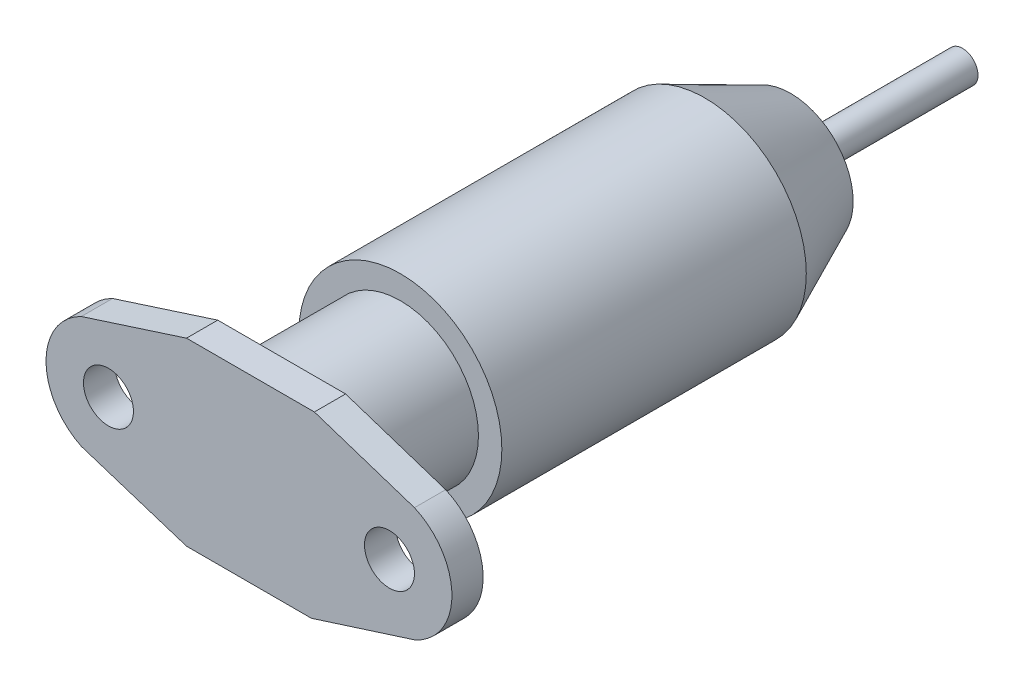
ISO-10303-21;
HEADER;
FILE_DESCRIPTION(('STEP AP214'),'2;1');
FILE_NAME('part.step','',(''),(''),'','','');
FILE_SCHEMA(('AUTOMOTIVE_DESIGN { 1 0 10303 214 1 1 1 1 }'));
ENDSEC;
DATA;
#1=APPLICATION_CONTEXT('core data for automotive mechanical design processes');
#2=APPLICATION_PROTOCOL_DEFINITION('international standard','automotive_design',2000,#1);
#3=PRODUCT_CONTEXT('',#1,'mechanical');
#4=PRODUCT('Part','Part','',(#3));
#5=PRODUCT_RELATED_PRODUCT_CATEGORY('part','',(#4));
#6=PRODUCT_DEFINITION_FORMATION('','',#4);
#7=PRODUCT_DEFINITION_CONTEXT('part definition',#1,'design');
#8=PRODUCT_DEFINITION('design','',#6,#7);
#9=PRODUCT_DEFINITION_SHAPE('','',#8);
#10=(LENGTH_UNIT() NAMED_UNIT(*) SI_UNIT(.MILLI.,.METRE.));
#11=(NAMED_UNIT(*) PLANE_ANGLE_UNIT() SI_UNIT($,.RADIAN.));
#12=(NAMED_UNIT(*) SI_UNIT($,.STERADIAN.) SOLID_ANGLE_UNIT());
#13=UNCERTAINTY_MEASURE_WITH_UNIT(LENGTH_MEASURE(1.E-05),#10,'distance_accuracy_value','');
#14=(GEOMETRIC_REPRESENTATION_CONTEXT(3) GLOBAL_UNCERTAINTY_ASSIGNED_CONTEXT((#13)) GLOBAL_UNIT_ASSIGNED_CONTEXT((#10,
#11,#12)) REPRESENTATION_CONTEXT('',''));
#15=CARTESIAN_POINT('',(0.,0.,0.));
#16=DIRECTION('',(0.,0.,1.));
#17=DIRECTION('',(1.,0.,0.));
#18=AXIS2_PLACEMENT_3D('',#15,#16,#17);
#19=CARTESIAN_POINT('',(-2.22651893290281,6.92250518995969,2.));
#20=DIRECTION('',(0.306187159635364,-0.95197133532183,0.));
#21=DIRECTION('',(0.95197133532183,0.306187159635364,0.));
#22=AXIS2_PLACEMENT_3D('',#19,#20,#21);
#23=PLANE('',#22);
#24=DIRECTION('',(-0.95197133532183,-0.306187159635364,0.));
#25=VECTOR('',#24,1.);
#26=CARTESIAN_POINT('',(-2.22651893290281,6.92250518995969,0.));
#27=LINE('',#26,#25);
#28=CARTESIAN_POINT('',(-7.25688073394496,5.3045655160948,0.));
#29=VERTEX_POINT('',#28);
#30=CARTESIAN_POINT('',(-13.9940276529524,3.13766426325439,0.));
#31=VERTEX_POINT('',#30);
#32=EDGE_CURVE('E157',#29,#31,#27,.T.);
#33=ORIENTED_EDGE('',*,*,#32,.T.);
#34=DIRECTION('',(0.,0.,-1.));
#35=VECTOR('',#34,1.);
#36=CARTESIAN_POINT('',(-13.9940276529524,3.13766426325439,2.));
#37=LINE('',#36,#35);
#38=CARTESIAN_POINT('',(-13.9940276529524,3.13766426325439,2.));
#39=VERTEX_POINT('',#38);
#40=EDGE_CURVE('E201',#39,#31,#37,.T.);
#41=ORIENTED_EDGE('',*,*,#40,.F.);
#42=DIRECTION('',(-0.95197133532183,-0.306187159635364,0.));
#43=VECTOR('',#42,1.);
#44=CARTESIAN_POINT('',(-2.22651893290281,6.92250518995969,2.));
#45=LINE('',#44,#43);
#46=CARTESIAN_POINT('',(-7.25688073394496,5.3045655160948,2.));
#47=VERTEX_POINT('',#46);
#48=EDGE_CURVE('E235',#47,#39,#45,.T.);
#49=ORIENTED_EDGE('',*,*,#48,.F.);
#50=DIRECTION('',(0.,0.,-1.));
#51=VECTOR('',#50,1.);
#52=CARTESIAN_POINT('',(-7.25688073394496,5.3045655160948,2.));
#53=LINE('',#52,#51);
#54=EDGE_CURVE('E63',#47,#29,#53,.T.);
#55=ORIENTED_EDGE('',*,*,#54,.T.);
#56=EDGE_LOOP('',(#33,#41,#49,#55));
#57=FACE_BOUND('',#56,.T.);
#58=ADVANCED_FACE('F43',(#57),#23,.F.);
#59=CARTESIAN_POINT('',(-12.256880733945,-0.465434483905203,2.));
#60=DIRECTION('',(0.,0.,-1.));
#61=DIRECTION('',(-1.,0.,0.));
#62=AXIS2_PLACEMENT_3D('',#59,#60,#61);
#63=CYLINDRICAL_SURFACE('',#62,4.);
#64=CARTESIAN_POINT('',(-12.256880733945,-0.465434483905203,0.));
#65=DIRECTION('',(0.,0.,1.));
#66=DIRECTION('',(1.,0.,0.));
#67=AXIS2_PLACEMENT_3D('',#64,#65,#66);
#68=CIRCLE('',#67,4.);
#69=CARTESIAN_POINT('',(-13.9940276529524,-4.06853323106481,0.));
#70=VERTEX_POINT('',#69);
#71=EDGE_CURVE('E160',#31,#70,#68,.T.);
#72=ORIENTED_EDGE('',*,*,#71,.T.);
#73=DIRECTION('',(0.,0.,-1.));
#74=VECTOR('',#73,1.);
#75=CARTESIAN_POINT('',(-13.9940276529524,-4.06853323106481,2.));
#76=LINE('',#75,#74);
#77=CARTESIAN_POINT('',(-13.9940276529524,-4.06853323106481,2.));
#78=VERTEX_POINT('',#77);
#79=EDGE_CURVE('E198',#78,#70,#76,.T.);
#80=ORIENTED_EDGE('',*,*,#79,.F.);
#81=CARTESIAN_POINT('',(-12.256880733945,-0.465434483905203,2.));
#82=DIRECTION('',(0.,0.,1.));
#83=DIRECTION('',(1.,0.,0.));
#84=AXIS2_PLACEMENT_3D('',#81,#82,#83);
#85=CIRCLE('',#84,4.);
#86=EDGE_CURVE('E102',#39,#78,#85,.T.);
#87=ORIENTED_EDGE('',*,*,#86,.F.);
#88=ORIENTED_EDGE('',*,*,#40,.T.);
#89=EDGE_LOOP('',(#72,#80,#87,#88));
#90=FACE_BOUND('',#89,.T.);
#91=ADVANCED_FACE('F272',(#90),#63,.T.);
#92=CARTESIAN_POINT('',(-2.49784992212738,-7.76610465518193,2.));
#93=DIRECTION('',(-0.306187159635364,-0.95197133532183,0.));
#94=DIRECTION('',(0.95197133532183,-0.306187159635364,0.));
#95=AXIS2_PLACEMENT_3D('',#92,#93,#94);
#96=PLANE('',#95);
#97=DIRECTION('',(-0.95197133532183,0.306187159635364,0.));
#98=VECTOR('',#97,1.);
#99=CARTESIAN_POINT('',(-2.49784992212738,-7.76610465518193,0.));
#100=LINE('',#99,#98);
#101=CARTESIAN_POINT('',(-7.25688073394496,-6.2354344839052,0.));
#102=VERTEX_POINT('',#101);
#103=EDGE_CURVE('E164',#102,#70,#100,.T.);
#104=ORIENTED_EDGE('',*,*,#103,.F.);
#105=DIRECTION('',(0.,0.,-1.));
#106=VECTOR('',#105,1.);
#107=CARTESIAN_POINT('',(-7.25688073394496,-6.2354344839052,2.));
#108=LINE('',#107,#106);
#109=CARTESIAN_POINT('',(-7.25688073394496,-6.2354344839052,2.));
#110=VERTEX_POINT('',#109);
#111=EDGE_CURVE('E195',#110,#102,#108,.T.);
#112=ORIENTED_EDGE('',*,*,#111,.F.);
#113=DIRECTION('',(-0.95197133532183,0.306187159635364,0.));
#114=VECTOR('',#113,1.);
#115=CARTESIAN_POINT('',(-2.49784992212738,-7.76610465518193,2.));
#116=LINE('',#115,#114);
#117=EDGE_CURVE('E240',#110,#78,#116,.T.);
#118=ORIENTED_EDGE('',*,*,#117,.T.);
#119=ORIENTED_EDGE('',*,*,#79,.T.);
#120=EDGE_LOOP('',(#104,#112,#118,#119));
#121=FACE_BOUND('',#120,.T.);
#122=ADVANCED_FACE('F277',(#121),#96,.T.);
#123=CARTESIAN_POINT('',(0.,-6.2354344839052,2.));
#124=DIRECTION('',(0.,1.,0.));
#125=DIRECTION('',(0.,0.,1.));
#126=AXIS2_PLACEMENT_3D('',#123,#124,#125);
#127=PLANE('',#126);
#128=DIRECTION('',(1.,0.,0.));
#129=VECTOR('',#128,1.);
#130=CARTESIAN_POINT('',(0.,-6.2354344839052,0.));
#131=LINE('',#130,#129);
#132=CARTESIAN_POINT('',(0.743119266055036,-6.2354344839052,0.));
#133=VERTEX_POINT('',#132);
#134=EDGE_CURVE('E168',#102,#133,#131,.T.);
#135=ORIENTED_EDGE('',*,*,#134,.T.);
#136=DIRECTION('',(0.,0.,-1.));
#137=VECTOR('',#136,1.);
#138=CARTESIAN_POINT('',(0.743119266055036,-6.2354344839052,2.));
#139=LINE('',#138,#137);
#140=CARTESIAN_POINT('',(0.743119266055036,-6.2354344839052,2.));
#141=VERTEX_POINT('',#140);
#142=EDGE_CURVE('E191',#141,#133,#139,.T.);
#143=ORIENTED_EDGE('',*,*,#142,.F.);
#144=DIRECTION('',(1.,0.,0.));
#145=VECTOR('',#144,1.);
#146=CARTESIAN_POINT('',(0.,-6.2354344839052,2.));
#147=LINE('',#146,#145);
#148=EDGE_CURVE('E244',#110,#141,#147,.T.);
#149=ORIENTED_EDGE('',*,*,#148,.F.);
#150=ORIENTED_EDGE('',*,*,#111,.T.);
#151=EDGE_LOOP('',(#135,#143,#149,#150));
#152=FACE_BOUND('',#151,.T.);
#153=ADVANCED_FACE('F251',(#152),#127,.F.);
#154=CARTESIAN_POINT('',(1.87302770760542,-5.87521810010068,2.));
#155=DIRECTION('',(-0.303739643333645,0.952755072968678,0.));
#156=DIRECTION('',(-0.952755072968678,-0.303739643333645,0.));
#157=AXIS2_PLACEMENT_3D('',#154,#155,#156);
#158=PLANE('',#157);
#159=DIRECTION('',(0.952755072968678,0.303739643333645,0.));
#160=VECTOR('',#159,1.);
#161=CARTESIAN_POINT('',(1.87302770760542,-5.87521810010068,0.));
#162=LINE('',#161,#160);
#163=CARTESIAN_POINT('',(7.34438998135382,-4.13094019203424,0.));
#164=VERTEX_POINT('',#163);
#165=EDGE_CURVE('E171',#133,#164,#162,.T.);
#166=ORIENTED_EDGE('',*,*,#165,.T.);
#167=DIRECTION('',(0.,0.,-1.));
#168=VECTOR('',#167,1.);
#169=CARTESIAN_POINT('',(7.34438998135382,-4.13094019203424,2.));
#170=LINE('',#169,#168);
#171=CARTESIAN_POINT('',(7.34438998135382,-4.13094019203424,2.));
#172=VERTEX_POINT('',#171);
#173=EDGE_CURVE('E128',#172,#164,#170,.T.);
#174=ORIENTED_EDGE('',*,*,#173,.F.);
#175=DIRECTION('',(0.952755072968678,0.303739643333645,0.));
#176=VECTOR('',#175,1.);
#177=CARTESIAN_POINT('',(1.87302770760542,-5.87521810010068,2.));
#178=LINE('',#177,#176);
#179=EDGE_CURVE('E136',#141,#172,#178,.T.);
#180=ORIENTED_EDGE('',*,*,#179,.F.);
#181=ORIENTED_EDGE('',*,*,#142,.T.);
#182=EDGE_LOOP('',(#166,#174,#180,#181));
#183=FACE_BOUND('',#182,.T.);
#184=ADVANCED_FACE('F255',(#183),#158,.F.);
#185=CARTESIAN_POINT('',(5.74311926605504,-0.465434483905203,2.));
#186=DIRECTION('',(0.,0.,-1.));
#187=DIRECTION('',(-1.,0.,0.));
#188=AXIS2_PLACEMENT_3D('',#185,#186,#187);
#189=CYLINDRICAL_SURFACE('',#188,4.);
#190=CARTESIAN_POINT('',(5.74311926605504,-0.465434483905203,0.));
#191=DIRECTION('',(0.,0.,1.));
#192=DIRECTION('',(1.,0.,0.));
#193=AXIS2_PLACEMENT_3D('',#190,#191,#192);
#194=CIRCLE('',#193,4.);
#195=CARTESIAN_POINT('',(7.34438998135382,3.20007122422383,0.));
#196=VERTEX_POINT('',#195);
#197=EDGE_CURVE('E123',#196,#164,#194,.F.);
#198=ORIENTED_EDGE('',*,*,#197,.F.);
#199=DIRECTION('',(0.,0.,-1.));
#200=VECTOR('',#199,1.);
#201=CARTESIAN_POINT('',(7.34438998135382,3.20007122422383,2.));
#202=LINE('',#201,#200);
#203=CARTESIAN_POINT('',(7.34438998135382,3.20007122422383,2.));
#204=VERTEX_POINT('',#203);
#205=EDGE_CURVE('E118',#204,#196,#202,.T.);
#206=ORIENTED_EDGE('',*,*,#205,.F.);
#207=CARTESIAN_POINT('',(5.74311926605504,-0.465434483905203,2.));
#208=DIRECTION('',(0.,0.,1.));
#209=DIRECTION('',(1.,0.,0.));
#210=AXIS2_PLACEMENT_3D('',#207,#208,#209);
#211=CIRCLE('',#210,4.);
#212=EDGE_CURVE('E121',#204,#172,#211,.F.);
#213=ORIENTED_EDGE('',*,*,#212,.T.);
#214=ORIENTED_EDGE('',*,*,#173,.T.);
#215=EDGE_LOOP('',(#198,#206,#213,#214));
#216=FACE_BOUND('',#215,.T.);
#217=ADVANCED_FACE('F120',(#216),#189,.T.);
#218=CARTESIAN_POINT('',(1.66265514148175,5.06513007028699,2.));
#219=DIRECTION('',(0.311882073003011,0.95012081996941,0.));
#220=DIRECTION('',(-0.95012081996941,0.311882073003011,0.));
#221=AXIS2_PLACEMENT_3D('',#218,#219,#220);
#222=PLANE('',#221);
#223=DIRECTION('',(0.95012081996941,-0.311882073003011,0.));
#224=VECTOR('',#223,1.);
#225=CARTESIAN_POINT('',(1.66265514148175,5.06513007028699,0.));
#226=LINE('',#225,#224);
#227=CARTESIAN_POINT('',(0.933236486827441,5.3045655160948,0.));
#228=VERTEX_POINT('',#227);
#229=EDGE_CURVE('E177',#228,#196,#226,.T.);
#230=ORIENTED_EDGE('',*,*,#229,.F.);
#231=DIRECTION('',(0.,0.,-1.));
#232=VECTOR('',#231,1.);
#233=CARTESIAN_POINT('',(0.933236486827441,5.3045655160948,2.));
#234=LINE('',#233,#232);
#235=CARTESIAN_POINT('',(0.933236486827441,5.3045655160948,2.));
#236=VERTEX_POINT('',#235);
#237=EDGE_CURVE('E89',#236,#228,#234,.T.);
#238=ORIENTED_EDGE('',*,*,#237,.F.);
#239=DIRECTION('',(0.95012081996941,-0.311882073003011,0.));
#240=VECTOR('',#239,1.);
#241=CARTESIAN_POINT('',(1.66265514148175,5.06513007028699,2.));
#242=LINE('',#241,#240);
#243=EDGE_CURVE('E134',#236,#204,#242,.T.);
#244=ORIENTED_EDGE('',*,*,#243,.T.);
#245=ORIENTED_EDGE('',*,*,#205,.T.);
#246=EDGE_LOOP('',(#230,#238,#244,#245));
#247=FACE_BOUND('',#246,.T.);
#248=ADVANCED_FACE('F140',(#247),#222,.T.);
#249=CARTESIAN_POINT('',(5.74311926605504,-0.465434483905203,2.));
#250=DIRECTION('',(0.,0.,-1.));
#251=DIRECTION('',(-1.,0.,0.));
#252=AXIS2_PLACEMENT_3D('',#249,#250,#251);
#253=CYLINDRICAL_SURFACE('',#252,1.6);
#254=CARTESIAN_POINT('',(5.74311926605504,-0.465434483905203,2.));
#255=DIRECTION('',(0.,0.,1.));
#256=DIRECTION('',(1.,0.,0.));
#257=AXIS2_PLACEMENT_3D('',#254,#255,#256);
#258=CIRCLE('',#257,1.6);
#259=CARTESIAN_POINT('',(7.34311926605504,-0.465434483905203,2.));
#260=VERTEX_POINT('',#259);
#261=EDGE_CURVE('E231',#260,#260,#258,.T.);
#262=ORIENTED_EDGE('',*,*,#261,.T.);
#263=EDGE_LOOP('',(#262));
#264=FACE_BOUND('',#263,.T.);
#265=CARTESIAN_POINT('',(5.74311926605504,-0.465434483905203,0.));
#266=DIRECTION('',(0.,0.,1.));
#267=DIRECTION('',(1.,0.,0.));
#268=AXIS2_PLACEMENT_3D('',#265,#266,#267);
#269=CIRCLE('',#268,1.6);
#270=CARTESIAN_POINT('',(7.34311926605504,-0.465434483905203,0.));
#271=VERTEX_POINT('',#270);
#272=EDGE_CURVE('E152',#271,#271,#269,.T.);
#273=ORIENTED_EDGE('',*,*,#272,.F.);
#274=EDGE_LOOP('',(#273));
#275=FACE_BOUND('',#274,.T.);
#276=ADVANCED_FACE('F267',(#264,#275),#253,.F.);
#277=CARTESIAN_POINT('',(-12.256880733945,-0.465434483905203,2.));
#278=DIRECTION('',(0.,0.,-1.));
#279=DIRECTION('',(-1.,0.,0.));
#280=AXIS2_PLACEMENT_3D('',#277,#278,#279);
#281=CYLINDRICAL_SURFACE('',#280,1.6);
#282=CARTESIAN_POINT('',(-12.256880733945,-0.465434483905203,2.));
#283=DIRECTION('',(0.,0.,1.));
#284=DIRECTION('',(1.,0.,0.));
#285=AXIS2_PLACEMENT_3D('',#282,#283,#284);
#286=CIRCLE('',#285,1.6);
#287=CARTESIAN_POINT('',(-10.656880733945,-0.465434483905203,2.));
#288=VERTEX_POINT('',#287);
#289=EDGE_CURVE('E184',#288,#288,#286,.T.);
#290=ORIENTED_EDGE('',*,*,#289,.T.);
#291=EDGE_LOOP('',(#290));
#292=FACE_BOUND('',#291,.T.);
#293=CARTESIAN_POINT('',(-12.256880733945,-0.465434483905203,0.));
#294=DIRECTION('',(0.,0.,1.));
#295=DIRECTION('',(1.,0.,0.));
#296=AXIS2_PLACEMENT_3D('',#293,#294,#295);
#297=CIRCLE('',#296,1.6);
#298=CARTESIAN_POINT('',(-10.656880733945,-0.465434483905203,0.));
#299=VERTEX_POINT('',#298);
#300=EDGE_CURVE('E148',#299,#299,#297,.T.);
#301=ORIENTED_EDGE('',*,*,#300,.F.);
#302=EDGE_LOOP('',(#301));
#303=FACE_BOUND('',#302,.T.);
#304=ADVANCED_FACE('F45',(#292,#303),#281,.F.);
#305=CARTESIAN_POINT('',(0.,5.3045655160948,2.));
#306=DIRECTION('',(0.,1.,0.));
#307=DIRECTION('',(0.,0.,1.));
#308=AXIS2_PLACEMENT_3D('',#305,#306,#307);
#309=PLANE('',#308);
#310=DIRECTION('',(1.,0.,0.));
#311=VECTOR('',#310,1.);
#312=CARTESIAN_POINT('',(0.,5.3045655160948,0.));
#313=LINE('',#312,#311);
#314=EDGE_CURVE('E180',#29,#228,#313,.T.);
#315=ORIENTED_EDGE('',*,*,#314,.F.);
#316=ORIENTED_EDGE('',*,*,#54,.F.);
#317=DIRECTION('',(1.,0.,0.));
#318=VECTOR('',#317,1.);
#319=CARTESIAN_POINT('',(0.,5.3045655160948,2.));
#320=LINE('',#319,#318);
#321=EDGE_CURVE('E142',#47,#236,#320,.T.);
#322=ORIENTED_EDGE('',*,*,#321,.T.);
#323=ORIENTED_EDGE('',*,*,#237,.T.);
#324=EDGE_LOOP('',(#315,#316,#322,#323));
#325=FACE_BOUND('',#324,.T.);
#326=ADVANCED_FACE('F258',(#325),#309,.T.);
#327=CARTESIAN_POINT('',(0.,0.,2.));
#328=DIRECTION('',(0.,0.,1.));
#329=DIRECTION('',(1.,0.,0.));
#330=AXIS2_PLACEMENT_3D('',#327,#328,#329);
#331=PLANE('',#330);
#332=ORIENTED_EDGE('',*,*,#289,.F.);
#333=EDGE_LOOP('',(#332));
#334=FACE_BOUND('',#333,.T.);
#335=ORIENTED_EDGE('',*,*,#261,.F.);
#336=EDGE_LOOP('',(#335));
#337=FACE_BOUND('',#336,.T.);
#338=ORIENTED_EDGE('',*,*,#48,.T.);
#339=ORIENTED_EDGE('',*,*,#86,.T.);
#340=ORIENTED_EDGE('',*,*,#117,.F.);
#341=ORIENTED_EDGE('',*,*,#148,.T.);
#342=ORIENTED_EDGE('',*,*,#179,.T.);
#343=ORIENTED_EDGE('',*,*,#212,.F.);
#344=ORIENTED_EDGE('',*,*,#243,.F.);
#345=ORIENTED_EDGE('',*,*,#321,.F.);
#346=EDGE_LOOP('',(#338,#339,#340,#341,#342,#343,#344,#345));
#347=FACE_BOUND('',#346,.T.);
#348=ADVANCED_FACE('F132',(#334,#337,#347),#331,.T.);
#349=CARTESIAN_POINT('',(0.,0.,0.));
#350=DIRECTION('',(0.,0.,1.));
#351=DIRECTION('',(1.,0.,0.));
#352=AXIS2_PLACEMENT_3D('',#349,#350,#351);
#353=PLANE('',#352);
#354=CARTESIAN_POINT('',(-3.25688073394496,-0.465434483905203,0.));
#355=DIRECTION('',(0.,0.,1.));
#356=DIRECTION('',(1.,0.,0.));
#357=AXIS2_PLACEMENT_3D('',#354,#355,#356);
#358=CIRCLE('',#357,5.);
#359=CARTESIAN_POINT('',(1.74311926605504,-0.465434483905203,0.));
#360=VERTEX_POINT('',#359);
#361=EDGE_CURVE('E54',#360,#360,#358,.F.);
#362=ORIENTED_EDGE('',*,*,#361,.F.);
#363=EDGE_LOOP('',(#362));
#364=FACE_BOUND('',#363,.T.);
#365=ORIENTED_EDGE('',*,*,#300,.T.);
#366=EDGE_LOOP('',(#365));
#367=FACE_BOUND('',#366,.T.);
#368=ORIENTED_EDGE('',*,*,#272,.T.);
#369=EDGE_LOOP('',(#368));
#370=FACE_BOUND('',#369,.T.);
#371=ORIENTED_EDGE('',*,*,#32,.F.);
#372=ORIENTED_EDGE('',*,*,#314,.T.);
#373=ORIENTED_EDGE('',*,*,#229,.T.);
#374=ORIENTED_EDGE('',*,*,#197,.T.);
#375=ORIENTED_EDGE('',*,*,#165,.F.);
#376=ORIENTED_EDGE('',*,*,#134,.F.);
#377=ORIENTED_EDGE('',*,*,#103,.T.);
#378=ORIENTED_EDGE('',*,*,#71,.F.);
#379=EDGE_LOOP('',(#371,#372,#373,#374,#375,#376,#377,#378));
#380=FACE_BOUND('',#379,.T.);
#381=ADVANCED_FACE('F257',(#364,#367,#370,#380),#353,.F.);
#382=CARTESIAN_POINT('',(-3.25688073394496,-0.465434483905203,-7.7));
#383=DIRECTION('',(0.,0.,1.));
#384=DIRECTION('',(1.,0.,0.));
#385=AXIS2_PLACEMENT_3D('',#382,#383,#384);
#386=CYLINDRICAL_SURFACE('',#385,5.);
#387=CARTESIAN_POINT('',(-3.25688073394496,-0.465434483905203,-7.7));
#388=DIRECTION('',(0.,0.,-1.));
#389=DIRECTION('',(-1.,0.,0.));
#390=AXIS2_PLACEMENT_3D('',#387,#388,#389);
#391=CIRCLE('',#390,5.);
#392=CARTESIAN_POINT('',(-8.25688073394496,-0.465434483905203,-7.7));
#393=VERTEX_POINT('',#392);
#394=EDGE_CURVE('E153',#393,#393,#391,.T.);
#395=ORIENTED_EDGE('',*,*,#394,.F.);
#396=EDGE_LOOP('',(#395));
#397=FACE_BOUND('',#396,.T.);
#398=ORIENTED_EDGE('',*,*,#361,.T.);
#399=EDGE_LOOP('',(#398));
#400=FACE_BOUND('',#399,.T.);
#401=ADVANCED_FACE('F290',(#397,#400),#386,.T.);
#402=CARTESIAN_POINT('',(-3.25688073394497,-0.465434483905203,-27.2));
#403=DIRECTION('',(0.,0.,1.));
#404=DIRECTION('',(1.,0.,0.));
#405=AXIS2_PLACEMENT_3D('',#402,#403,#404);
#406=CYLINDRICAL_SURFACE('',#405,6.5);
#407=CARTESIAN_POINT('',(-3.25688073394497,-0.465434483905203,-27.2));
#408=DIRECTION('',(0.,0.,1.));
#409=DIRECTION('',(1.,0.,0.));
#410=AXIS2_PLACEMENT_3D('',#407,#408,#409);
#411=CIRCLE('',#410,6.5);
#412=CARTESIAN_POINT('',(3.24311926605503,-0.465434483905203,-27.2));
#413=VERTEX_POINT('',#412);
#414=EDGE_CURVE('E206',#413,#413,#411,.F.);
#415=ORIENTED_EDGE('',*,*,#414,.F.);
#416=EDGE_LOOP('',(#415));
#417=FACE_BOUND('',#416,.T.);
#418=CARTESIAN_POINT('',(-3.25688073394497,-0.465434483905203,-7.7));
#419=DIRECTION('',(0.,0.,-1.));
#420=DIRECTION('',(-1.,0.,0.));
#421=AXIS2_PLACEMENT_3D('',#418,#419,#420);
#422=CIRCLE('',#421,6.5);
#423=CARTESIAN_POINT('',(-9.75688073394496,-0.465434483905203,-7.7));
#424=VERTEX_POINT('',#423);
#425=EDGE_CURVE('E209',#424,#424,#422,.T.);
#426=ORIENTED_EDGE('',*,*,#425,.T.);
#427=EDGE_LOOP('',(#426));
#428=FACE_BOUND('',#427,.T.);
#429=ADVANCED_FACE('F295',(#417,#428),#406,.T.);
#430=CARTESIAN_POINT('',(0.,0.,-7.7));
#431=DIRECTION('',(0.,0.,-1.));
#432=DIRECTION('',(-1.,0.,0.));
#433=AXIS2_PLACEMENT_3D('',#430,#431,#432);
#434=PLANE('',#433);
#435=ORIENTED_EDGE('',*,*,#394,.T.);
#436=EDGE_LOOP('',(#435));
#437=FACE_BOUND('',#436,.T.);
#438=ORIENTED_EDGE('',*,*,#425,.F.);
#439=EDGE_LOOP('',(#438));
#440=FACE_BOUND('',#439,.T.);
#441=ADVANCED_FACE('F303',(#437,#440),#434,.F.);
#442=CARTESIAN_POINT('',(-3.25688073394497,-0.465434483905203,-32.7));
#443=DIRECTION('',(0.,0.,-1.));
#444=DIRECTION('',(-1.,0.,0.));
#445=AXIS2_PLACEMENT_3D('',#442,#443,#444);
#446=PLANE('',#445);
#447=CARTESIAN_POINT('',(-3.25688073394497,-0.465434483905203,-32.7));
#448=DIRECTION('',(0.,0.,-1.));
#449=DIRECTION('',(-1.,0.,0.));
#450=AXIS2_PLACEMENT_3D('',#447,#448,#449);
#451=CIRCLE('',#450,1.);
#452=CARTESIAN_POINT('',(-4.25688073394497,-0.465434483905203,-32.7));
#453=VERTEX_POINT('',#452);
#454=EDGE_CURVE('E12',#453,#453,#451,.T.);
#455=ORIENTED_EDGE('',*,*,#454,.F.);
#456=EDGE_LOOP('',(#455));
#457=FACE_BOUND('',#456,.T.);
#458=CARTESIAN_POINT('',(-3.25688073394497,-0.465434483905203,-32.7));
#459=DIRECTION('',(0.,0.,-1.));
#460=DIRECTION('',(-1.,0.,0.));
#461=AXIS2_PLACEMENT_3D('',#458,#459,#460);
#462=CIRCLE('',#461,4.);
#463=CARTESIAN_POINT('',(-7.25688073394497,-0.465434483905203,-32.7));
#464=VERTEX_POINT('',#463);
#465=EDGE_CURVE('E217',#464,#464,#462,.T.);
#466=ORIENTED_EDGE('',*,*,#465,.T.);
#467=EDGE_LOOP('',(#466));
#468=FACE_BOUND('',#467,.T.);
#469=ADVANCED_FACE('F307',(#457,#468),#446,.T.);
#470=CARTESIAN_POINT('',(-3.25688073394497,-0.465434483905203,-32.7));
#471=DIRECTION('',(0.,0.,1.));
#472=DIRECTION('',(1.,0.,0.));
#473=AXIS2_PLACEMENT_3D('',#470,#471,#472);
#474=CONICAL_SURFACE('',#473,4.,0.426627493126876);
#475=ORIENTED_EDGE('',*,*,#465,.F.);
#476=EDGE_LOOP('',(#475));
#477=FACE_BOUND('',#476,.T.);
#478=ORIENTED_EDGE('',*,*,#414,.T.);
#479=EDGE_LOOP('',(#478));
#480=FACE_BOUND('',#479,.T.);
#481=ADVANCED_FACE('F309',(#477,#480),#474,.T.);
#482=CARTESIAN_POINT('',(-3.25688073394497,-0.465434483905203,-43.7));
#483=DIRECTION('',(0.,0.,1.));
#484=DIRECTION('',(1.,0.,0.));
#485=AXIS2_PLACEMENT_3D('',#482,#483,#484);
#486=CYLINDRICAL_SURFACE('',#485,1.);
#487=CARTESIAN_POINT('',(-3.25688073394497,-0.465434483905203,-43.7));
#488=DIRECTION('',(0.,0.,-1.));
#489=DIRECTION('',(-1.,0.,0.));
#490=AXIS2_PLACEMENT_3D('',#487,#488,#489);
#491=CIRCLE('',#490,1.);
#492=CARTESIAN_POINT('',(-4.25688073394497,-0.465434483905203,-43.7));
#493=VERTEX_POINT('',#492);
#494=EDGE_CURVE('E223',#493,#493,#491,.T.);
#495=ORIENTED_EDGE('',*,*,#494,.F.);
#496=EDGE_LOOP('',(#495));
#497=FACE_BOUND('',#496,.T.);
#498=ORIENTED_EDGE('',*,*,#454,.T.);
#499=EDGE_LOOP('',(#498));
#500=FACE_BOUND('',#499,.T.);
#501=ADVANCED_FACE('F313',(#497,#500),#486,.T.);
#502=CARTESIAN_POINT('',(-3.25688073394497,-0.465434483905203,-43.7));
#503=DIRECTION('',(0.,0.,-1.));
#504=DIRECTION('',(-1.,0.,0.));
#505=AXIS2_PLACEMENT_3D('',#502,#503,#504);
#506=PLANE('',#505);
#507=ORIENTED_EDGE('',*,*,#494,.T.);
#508=EDGE_LOOP('',(#507));
#509=FACE_BOUND('',#508,.T.);
#510=ADVANCED_FACE('F346',(#509),#506,.T.);
#511=CLOSED_SHELL('',(#58,#91,#122,#153,#184,#217,#248,#276,#304,#326,#348,#381,#401,#429,#441,
#469,#481,#501,#510));
#512=MANIFOLD_SOLID_BREP('B2',#511);
#513=ADVANCED_BREP_SHAPE_REPRESENTATION('',(#18,#512),#14);
#514=SHAPE_DEFINITION_REPRESENTATION(#9,#513);
ENDSEC;
END-ISO-10303-21;
